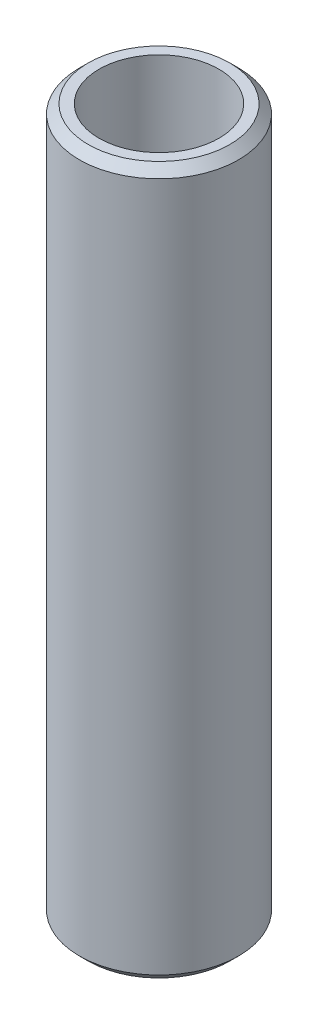
ISO-10303-21;
HEADER;
FILE_DESCRIPTION(('STEP AP214'),'2;1');
FILE_NAME('part.step','',(''),(''),'','','');
FILE_SCHEMA(('AUTOMOTIVE_DESIGN { 1 0 10303 214 1 1 1 1 }'));
ENDSEC;
DATA;
#1=APPLICATION_CONTEXT('core data for automotive mechanical design processes');
#2=APPLICATION_PROTOCOL_DEFINITION('international standard','automotive_design',2000,#1);
#3=PRODUCT_CONTEXT('',#1,'mechanical');
#4=PRODUCT('Part','Part','',(#3));
#5=PRODUCT_RELATED_PRODUCT_CATEGORY('part','',(#4));
#6=PRODUCT_DEFINITION_FORMATION('','',#4);
#7=PRODUCT_DEFINITION_CONTEXT('part definition',#1,'design');
#8=PRODUCT_DEFINITION('design','',#6,#7);
#9=PRODUCT_DEFINITION_SHAPE('','',#8);
#10=(LENGTH_UNIT() NAMED_UNIT(*) SI_UNIT(.MILLI.,.METRE.));
#11=(NAMED_UNIT(*) PLANE_ANGLE_UNIT() SI_UNIT($,.RADIAN.));
#12=(NAMED_UNIT(*) SI_UNIT($,.STERADIAN.) SOLID_ANGLE_UNIT());
#13=UNCERTAINTY_MEASURE_WITH_UNIT(LENGTH_MEASURE(1.E-05),#10,'distance_accuracy_value','');
#14=(GEOMETRIC_REPRESENTATION_CONTEXT(3) GLOBAL_UNCERTAINTY_ASSIGNED_CONTEXT((#13)) GLOBAL_UNIT_ASSIGNED_CONTEXT((#10,
#11,#12)) REPRESENTATION_CONTEXT('',''));
#15=CARTESIAN_POINT('',(0.,0.,0.));
#16=DIRECTION('',(0.,0.,1.));
#17=DIRECTION('',(1.,0.,0.));
#18=AXIS2_PLACEMENT_3D('',#15,#16,#17);
#19=CARTESIAN_POINT('',(0.,466.586146643028,0.));
#20=DIRECTION('',(0.,-1.,0.));
#21=DIRECTION('',(0.,0.,-1.));
#22=AXIS2_PLACEMENT_3D('',#19,#20,#21);
#23=CYLINDRICAL_SURFACE('',#22,52.5);
#24=CARTESIAN_POINT('',(0.,460.777404871491,0.));
#25=DIRECTION('',(0.,1.,0.));
#26=DIRECTION('',(0.,0.,1.));
#27=AXIS2_PLACEMENT_3D('',#24,#25,#26);
#28=CIRCLE('',#27,52.5);
#29=CARTESIAN_POINT('',(0.,460.777404871491,-52.5));
#30=VERTEX_POINT('',#29);
#31=EDGE_CURVE('E50',#30,#30,#28,.F.);
#32=ORIENTED_EDGE('',*,*,#31,.T.);
#33=EDGE_LOOP('',(#32));
#34=FACE_BOUND('',#33,.T.);
#35=CARTESIAN_POINT('',(0.,5.80874177153651,0.));
#36=DIRECTION('',(0.,1.,0.));
#37=DIRECTION('',(0.,0.,1.));
#38=AXIS2_PLACEMENT_3D('',#35,#36,#37);
#39=CIRCLE('',#38,52.5);
#40=CARTESIAN_POINT('',(0.,5.80874177153651,52.5));
#41=VERTEX_POINT('',#40);
#42=EDGE_CURVE('E51',#41,#41,#39,.T.);
#43=ORIENTED_EDGE('',*,*,#42,.T.);
#44=EDGE_LOOP('',(#43));
#45=FACE_BOUND('',#44,.T.);
#46=ADVANCED_FACE('F39',(#34,#45),#23,.T.);
#47=CARTESIAN_POINT('',(0.,466.586146643028,0.));
#48=DIRECTION('',(0.,1.,0.));
#49=DIRECTION('',(0.,0.,1.));
#50=AXIS2_PLACEMENT_3D('',#47,#48,#49);
#51=PLANE('',#50);
#52=CARTESIAN_POINT('',(0.,466.586146643028,0.));
#53=DIRECTION('',(0.,1.,0.));
#54=DIRECTION('',(0.,0.,1.));
#55=AXIS2_PLACEMENT_3D('',#52,#53,#54);
#56=CIRCLE('',#55,46.6912582284634);
#57=CARTESIAN_POINT('',(0.,466.586146643028,-46.6912582284635));
#58=VERTEX_POINT('',#57);
#59=EDGE_CURVE('E54',#58,#58,#56,.T.);
#60=ORIENTED_EDGE('',*,*,#59,.T.);
#61=EDGE_LOOP('',(#60));
#62=FACE_BOUND('',#61,.T.);
#63=CARTESIAN_POINT('',(0.,466.586146643028,0.));
#64=DIRECTION('',(0.,1.,0.));
#65=DIRECTION('',(0.,0.,1.));
#66=AXIS2_PLACEMENT_3D('',#63,#64,#65);
#67=CIRCLE('',#66,39.5440927466232);
#68=CARTESIAN_POINT('',(0.,466.586146643028,39.5440927466232));
#69=VERTEX_POINT('',#68);
#70=EDGE_CURVE('E58',#69,#69,#67,.T.);
#71=ORIENTED_EDGE('',*,*,#70,.F.);
#72=EDGE_LOOP('',(#71));
#73=FACE_BOUND('',#72,.T.);
#74=ADVANCED_FACE('F69',(#62,#73),#51,.T.);
#75=CARTESIAN_POINT('',(0.,0.,0.));
#76=DIRECTION('',(0.,1.,0.));
#77=DIRECTION('',(0.,0.,1.));
#78=AXIS2_PLACEMENT_3D('',#75,#76,#77);
#79=PLANE('',#78);
#80=CARTESIAN_POINT('',(0.,0.,0.));
#81=DIRECTION('',(0.,1.,0.));
#82=DIRECTION('',(0.,0.,1.));
#83=AXIS2_PLACEMENT_3D('',#80,#81,#82);
#84=CIRCLE('',#83,46.6912582284634);
#85=CARTESIAN_POINT('',(0.,0.,46.6912582284634));
#86=VERTEX_POINT('',#85);
#87=EDGE_CURVE('E10',#86,#86,#84,.F.);
#88=ORIENTED_EDGE('',*,*,#87,.T.);
#89=EDGE_LOOP('',(#88));
#90=FACE_BOUND('',#89,.T.);
#91=CARTESIAN_POINT('',(0.,0.,0.));
#92=DIRECTION('',(0.,1.,0.));
#93=DIRECTION('',(0.,0.,1.));
#94=AXIS2_PLACEMENT_3D('',#91,#92,#93);
#95=CIRCLE('',#94,39.5440927466232);
#96=CARTESIAN_POINT('',(0.,0.,39.5440927466232));
#97=VERTEX_POINT('',#96);
#98=EDGE_CURVE('E63',#97,#97,#95,.T.);
#99=ORIENTED_EDGE('',*,*,#98,.T.);
#100=EDGE_LOOP('',(#99));
#101=FACE_BOUND('',#100,.T.);
#102=ADVANCED_FACE('F75',(#90,#101),#79,.F.);
#103=CARTESIAN_POINT('',(0.,466.586146643028,0.));
#104=DIRECTION('',(0.,-1.,0.));
#105=DIRECTION('',(0.,0.,-1.));
#106=AXIS2_PLACEMENT_3D('',#103,#104,#105);
#107=CYLINDRICAL_SURFACE('',#106,39.5440927466232);
#108=ORIENTED_EDGE('',*,*,#70,.T.);
#109=EDGE_LOOP('',(#108));
#110=FACE_BOUND('',#109,.T.);
#111=ORIENTED_EDGE('',*,*,#98,.F.);
#112=EDGE_LOOP('',(#111));
#113=FACE_BOUND('',#112,.T.);
#114=ADVANCED_FACE('F70',(#110,#113),#107,.F.);
#115=CARTESIAN_POINT('',(0.,466.586146643028,0.));
#116=DIRECTION('',(0.,-1.,0.));
#117=DIRECTION('',(0.,0.,-1.));
#118=AXIS2_PLACEMENT_3D('',#115,#116,#117);
#119=CONICAL_SURFACE('',#118,46.6912582284634,0.785398163397444);
#120=CARTESIAN_POINT('',(0.,460.777404871491,-52.5));
#121=CARTESIAN_POINT('',(0.,460.837912598278,-52.4394922732132));
#122=CARTESIAN_POINT('',(0.,460.898420325065,-52.3789845464263));
#123=CARTESIAN_POINT('',(0.,461.019435778638,-52.2579690928527));
#124=CARTESIAN_POINT('',(0.,461.079943505425,-52.1974613660658));
#125=CARTESIAN_POINT('',(0.,461.200958958999,-52.0764459124921));
#126=CARTESIAN_POINT('',(0.,461.261466685786,-52.0159381857053));
#127=CARTESIAN_POINT('',(0.,461.382482139359,-51.8949227321316));
#128=CARTESIAN_POINT('',(0.,461.442989866146,-51.8344150053448));
#129=CARTESIAN_POINT('',(0.,461.56400531972,-51.7133995517711));
#130=CARTESIAN_POINT('',(0.,461.624513046507,-51.6528918249843));
#131=CARTESIAN_POINT('',(0.,461.74552850008,-51.5318763714106));
#132=CARTESIAN_POINT('',(0.,461.806036226867,-51.4713686446238));
#133=CARTESIAN_POINT('',(0.,461.927051680441,-51.3503531910501));
#134=CARTESIAN_POINT('',(0.,461.987559407228,-51.2898454642632));
#135=CARTESIAN_POINT('',(0.,462.108574860801,-51.1688300106896));
#136=CARTESIAN_POINT('',(0.,462.169082587588,-51.1083222839027));
#137=CARTESIAN_POINT('',(0.,462.290098041162,-50.987306830329));
#138=CARTESIAN_POINT('',(0.,462.350605767949,-50.9267991035422));
#139=CARTESIAN_POINT('',(0.,462.471621221523,-50.8057836499685));
#140=CARTESIAN_POINT('',(0.,462.532128948309,-50.7452759231817));
#141=CARTESIAN_POINT('',(0.,462.653144401883,-50.624260469608));
#142=CARTESIAN_POINT('',(0.,462.71365212867,-50.5637527428212));
#143=CARTESIAN_POINT('',(0.,462.834667582244,-50.4427372892475));
#144=CARTESIAN_POINT('',(0.,462.89517530903,-50.3822295624607));
#145=CARTESIAN_POINT('',(0.,463.016190762604,-50.261214108887));
#146=CARTESIAN_POINT('',(0.,463.076698489391,-50.2007063821001));
#147=CARTESIAN_POINT('',(0.,463.197713942965,-50.0796909285265));
#148=CARTESIAN_POINT('',(0.,463.258221669751,-50.0191832017396));
#149=CARTESIAN_POINT('',(0.,463.379237123325,-49.8981677481659));
#150=CARTESIAN_POINT('',(0.,463.439744850112,-49.8376600213791));
#151=CARTESIAN_POINT('',(0.,463.560760303686,-49.7166445678054));
#152=CARTESIAN_POINT('',(0.,463.621268030472,-49.6561368410186));
#153=CARTESIAN_POINT('',(0.,463.742283484046,-49.5351213874449));
#154=CARTESIAN_POINT('',(0.,463.802791210833,-49.4746136606581));
#155=CARTESIAN_POINT('',(0.,463.923806664407,-49.3535982070844));
#156=CARTESIAN_POINT('',(0.,463.984314391194,-49.2930904802975));
#157=CARTESIAN_POINT('',(0.,464.105329844767,-49.1720750267239));
#158=CARTESIAN_POINT('',(0.,464.165837571554,-49.111567299937));
#159=CARTESIAN_POINT('',(0.,464.286853025128,-48.9905518463633));
#160=CARTESIAN_POINT('',(0.,464.347360751915,-48.9300441195765));
#161=CARTESIAN_POINT('',(0.,464.468376205488,-48.8090286660028));
#162=CARTESIAN_POINT('',(0.,464.528883932275,-48.748520939216));
#163=CARTESIAN_POINT('',(0.,464.649899385849,-48.6275054856423));
#164=CARTESIAN_POINT('',(0.,464.710407112636,-48.5669977588555));
#165=CARTESIAN_POINT('',(0.,464.831422566209,-48.4459823052818));
#166=CARTESIAN_POINT('',(0.,464.891930292996,-48.385474578495));
#167=CARTESIAN_POINT('',(0.,465.01294574657,-48.2644591249213));
#168=CARTESIAN_POINT('',(0.,465.073453473357,-48.2039513981344));
#169=CARTESIAN_POINT('',(0.,465.19446892693,-48.0829359445608));
#170=CARTESIAN_POINT('',(0.,465.254976653717,-48.0224282177739));
#171=CARTESIAN_POINT('',(0.,465.375992107291,-47.9014127642002));
#172=CARTESIAN_POINT('',(0.,465.436499834078,-47.8409050374134));
#173=CARTESIAN_POINT('',(0.,465.557515287651,-47.7198895838397));
#174=CARTESIAN_POINT('',(0.,465.618023014438,-47.6593818570529));
#175=CARTESIAN_POINT('',(0.,465.739038468012,-47.5383664034792));
#176=CARTESIAN_POINT('',(0.,465.799546194799,-47.4778586766924));
#177=CARTESIAN_POINT('',(0.,465.920561648372,-47.3568432231187));
#178=CARTESIAN_POINT('',(0.,465.981069375159,-47.2963354963318));
#179=CARTESIAN_POINT('',(0.,466.102084828733,-47.1753200427582));
#180=CARTESIAN_POINT('',(0.,466.16259255552,-47.1148123159713));
#181=CARTESIAN_POINT('',(0.,466.283608009093,-46.9937968623977));
#182=CARTESIAN_POINT('',(0.,466.34411573588,-46.9332891356108));
#183=CARTESIAN_POINT('',(0.,466.465131189454,-46.8122736820371));
#184=CARTESIAN_POINT('',(0.,466.525638916241,-46.7517659552503));
#185=CARTESIAN_POINT('',(0.,466.586146643028,-46.6912582284635));
#186=B_SPLINE_CURVE_WITH_KNOTS('',3,(#120,#121,#122,#123,#124,#125,#126,#127,#128,#129,#130,
#131,#132,#133,#134,#135,#136,#137,#138,#139,#140,#141,#142,#143,#144,#145,#146,#147,#148,#149,
#150,#151,#152,#153,#154,#155,#156,#157,#158,#159,#160,#161,#162,#163,#164,#165,#166,#167,#168,
#169,#170,#171,#172,#173,#174,#175,#176,#177,#178,#179,#180,#181,#182,#183,#184,#185),
.UNSPECIFIED.,.F.,.F.,(4,2,2,2,2,2,2,2,2,2,2,2,2,2,2,2,2,2,2,2,2,2,2,2,2,2,2,2,2,2,2,2,4),(0.,
0.256712543550902,0.513425087101849,0.770137630652795,1.02685017420374,1.28356271775468,
1.54027526130562,1.79698780485657,2.05370034840751,2.31041289195846,2.5671254355094,
2.82383797906035,3.08055052261129,3.33726306616223,3.59397560971317,3.85068815326412,
4.10740069681507,4.36411324036601,4.62082578391696,4.8775383274679,5.13425087101884,
5.39096341456978,5.64767595812073,5.90438850167167,6.16110104522262,6.41781358877356,
6.67452613232451,6.93123867587545,7.1879512194264,7.44466376297734,7.70137630652828,
7.95808885007922,8.21480139363017),.UNSPECIFIED.);
#187=EDGE_CURVE('BSEAM81',#30,#58,#186,.T.);
#188=ORIENTED_EDGE('',*,*,#31,.F.);
#189=ORIENTED_EDGE('',*,*,#59,.F.);
#190=ORIENTED_EDGE('',*,*,#187,.T.);
#191=ORIENTED_EDGE('',*,*,#187,.F.);
#192=EDGE_LOOP('',(#188,#190,#189,#191));
#193=FACE_BOUND('',#192,.T.);
#194=ADVANCED_FACE('F81',(#193),#119,.T.);
#195=CARTESIAN_POINT('',(0.,5.80874177153651,0.));
#196=DIRECTION('',(0.,1.,0.));
#197=DIRECTION('',(0.,0.,1.));
#198=AXIS2_PLACEMENT_3D('',#195,#196,#197);
#199=CONICAL_SURFACE('',#198,52.5,0.785398163397454);
#200=ORIENTED_EDGE('',*,*,#87,.F.);
#201=EDGE_LOOP('',(#200));
#202=FACE_BOUND('',#201,.T.);
#203=ORIENTED_EDGE('',*,*,#42,.F.);
#204=EDGE_LOOP('',(#203));
#205=FACE_BOUND('',#204,.T.);
#206=ADVANCED_FACE('F45',(#202,#205),#199,.T.);
#207=CLOSED_SHELL('',(#46,#74,#102,#114,#194,#206));
#208=MANIFOLD_SOLID_BREP('B2',#207);
#209=ADVANCED_BREP_SHAPE_REPRESENTATION('',(#18,#208),#14);
#210=SHAPE_DEFINITION_REPRESENTATION(#9,#209);
ENDSEC;
END-ISO-10303-21;
